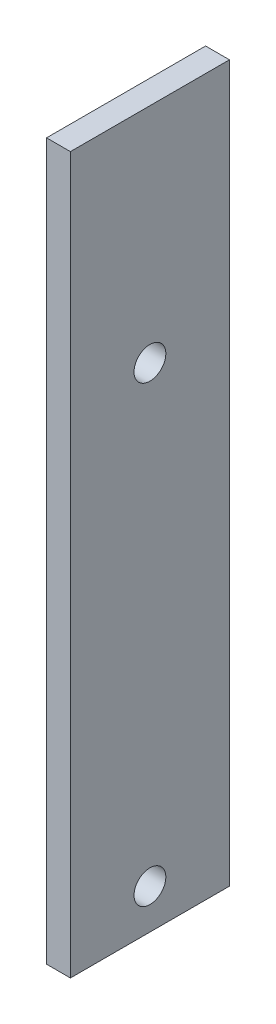
ISO-10303-21;
HEADER;
FILE_DESCRIPTION(('STEP AP214'),'2;1');
FILE_NAME('part.step','',(''),(''),'','','');
FILE_SCHEMA(('AUTOMOTIVE_DESIGN { 1 0 10303 214 1 1 1 1 }'));
ENDSEC;
DATA;
#1=APPLICATION_CONTEXT('core data for automotive mechanical design processes');
#2=APPLICATION_PROTOCOL_DEFINITION('international standard','automotive_design',2000,#1);
#3=PRODUCT_CONTEXT('',#1,'mechanical');
#4=PRODUCT('Part','Part','',(#3));
#5=PRODUCT_RELATED_PRODUCT_CATEGORY('part','',(#4));
#6=PRODUCT_DEFINITION_FORMATION('','',#4);
#7=PRODUCT_DEFINITION_CONTEXT('part definition',#1,'design');
#8=PRODUCT_DEFINITION('design','',#6,#7);
#9=PRODUCT_DEFINITION_SHAPE('','',#8);
#10=(LENGTH_UNIT() NAMED_UNIT(*) SI_UNIT(.MILLI.,.METRE.));
#11=(NAMED_UNIT(*) PLANE_ANGLE_UNIT() SI_UNIT($,.RADIAN.));
#12=(NAMED_UNIT(*) SI_UNIT($,.STERADIAN.) SOLID_ANGLE_UNIT());
#13=UNCERTAINTY_MEASURE_WITH_UNIT(LENGTH_MEASURE(1.E-05),#10,'distance_accuracy_value','');
#14=(GEOMETRIC_REPRESENTATION_CONTEXT(3) GLOBAL_UNCERTAINTY_ASSIGNED_CONTEXT((#13)) GLOBAL_UNIT_ASSIGNED_CONTEXT((#10,
#11,#12)) REPRESENTATION_CONTEXT('',''));
#15=CARTESIAN_POINT('',(0.,0.,0.));
#16=DIRECTION('',(0.,0.,1.));
#17=DIRECTION('',(1.,0.,0.));
#18=AXIS2_PLACEMENT_3D('',#15,#16,#17);
#19=CARTESIAN_POINT('',(3.,-45.,-10.));
#20=DIRECTION('',(0.,0.,1.));
#21=DIRECTION('',(1.,0.,0.));
#22=AXIS2_PLACEMENT_3D('',#19,#20,#21);
#23=PLANE('',#22);
#24=DIRECTION('',(0.,1.,0.));
#25=VECTOR('',#24,1.);
#26=CARTESIAN_POINT('',(0.,-45.,-10.));
#27=LINE('',#26,#25);
#28=CARTESIAN_POINT('',(0.,-45.,-10.));
#29=VERTEX_POINT('',#28);
#30=CARTESIAN_POINT('',(0.,45.,-10.));
#31=VERTEX_POINT('',#30);
#32=EDGE_CURVE('E96',#29,#31,#27,.T.);
#33=ORIENTED_EDGE('',*,*,#32,.T.);
#34=DIRECTION('',(-1.,0.,0.));
#35=VECTOR('',#34,1.);
#36=CARTESIAN_POINT('',(3.,45.,-10.));
#37=LINE('',#36,#35);
#38=CARTESIAN_POINT('',(3.,45.,-10.));
#39=VERTEX_POINT('',#38);
#40=EDGE_CURVE('E11',#39,#31,#37,.T.);
#41=ORIENTED_EDGE('',*,*,#40,.F.);
#42=DIRECTION('',(0.,1.,0.));
#43=VECTOR('',#42,1.);
#44=CARTESIAN_POINT('',(3.,-45.,-10.));
#45=LINE('',#44,#43);
#46=CARTESIAN_POINT('',(3.,-45.,-10.));
#47=VERTEX_POINT('',#46);
#48=EDGE_CURVE('E84',#47,#39,#45,.T.);
#49=ORIENTED_EDGE('',*,*,#48,.F.);
#50=DIRECTION('',(-1.,0.,0.));
#51=VECTOR('',#50,1.);
#52=CARTESIAN_POINT('',(3.,-45.,-10.));
#53=LINE('',#52,#51);
#54=EDGE_CURVE('E92',#47,#29,#53,.T.);
#55=ORIENTED_EDGE('',*,*,#54,.T.);
#56=EDGE_LOOP('',(#33,#41,#49,#55));
#57=FACE_BOUND('',#56,.T.);
#58=ADVANCED_FACE('F33',(#57),#23,.F.);
#59=CARTESIAN_POINT('',(3.,45.,10.));
#60=DIRECTION('',(0.,-1.,0.));
#61=DIRECTION('',(0.,0.,-1.));
#62=AXIS2_PLACEMENT_3D('',#59,#60,#61);
#63=PLANE('',#62);
#64=DIRECTION('',(0.,0.,1.));
#65=VECTOR('',#64,1.);
#66=CARTESIAN_POINT('',(0.,45.,10.));
#67=LINE('',#66,#65);
#68=CARTESIAN_POINT('',(0.,45.,10.));
#69=VERTEX_POINT('',#68);
#70=EDGE_CURVE('E88',#31,#69,#67,.T.);
#71=ORIENTED_EDGE('',*,*,#70,.T.);
#72=DIRECTION('',(-1.,0.,0.));
#73=VECTOR('',#72,1.);
#74=CARTESIAN_POINT('',(3.,45.,10.));
#75=LINE('',#74,#73);
#76=CARTESIAN_POINT('',(3.,45.,10.));
#77=VERTEX_POINT('',#76);
#78=EDGE_CURVE('E41',#77,#69,#75,.T.);
#79=ORIENTED_EDGE('',*,*,#78,.F.);
#80=DIRECTION('',(0.,0.,1.));
#81=VECTOR('',#80,1.);
#82=CARTESIAN_POINT('',(3.,45.,10.));
#83=LINE('',#82,#81);
#84=EDGE_CURVE('E79',#39,#77,#83,.T.);
#85=ORIENTED_EDGE('',*,*,#84,.F.);
#86=ORIENTED_EDGE('',*,*,#40,.T.);
#87=EDGE_LOOP('',(#71,#79,#85,#86));
#88=FACE_BOUND('',#87,.T.);
#89=ADVANCED_FACE('F87',(#88),#63,.F.);
#90=CARTESIAN_POINT('',(3.,-45.,10.));
#91=DIRECTION('',(0.,0.,-1.));
#92=DIRECTION('',(-1.,0.,0.));
#93=AXIS2_PLACEMENT_3D('',#90,#91,#92);
#94=PLANE('',#93);
#95=DIRECTION('',(0.,-1.,0.));
#96=VECTOR('',#95,1.);
#97=CARTESIAN_POINT('',(0.,-45.,10.));
#98=LINE('',#97,#96);
#99=CARTESIAN_POINT('',(0.,-45.,10.));
#100=VERTEX_POINT('',#99);
#101=EDGE_CURVE('E66',#69,#100,#98,.T.);
#102=ORIENTED_EDGE('',*,*,#101,.T.);
#103=DIRECTION('',(-1.,0.,0.));
#104=VECTOR('',#103,1.);
#105=CARTESIAN_POINT('',(3.,-45.,10.));
#106=LINE('',#105,#104);
#107=CARTESIAN_POINT('',(3.,-45.,10.));
#108=VERTEX_POINT('',#107);
#109=EDGE_CURVE('E89',#108,#100,#106,.T.);
#110=ORIENTED_EDGE('',*,*,#109,.F.);
#111=DIRECTION('',(0.,-1.,0.));
#112=VECTOR('',#111,1.);
#113=CARTESIAN_POINT('',(3.,-45.,10.));
#114=LINE('',#113,#112);
#115=EDGE_CURVE('E82',#77,#108,#114,.T.);
#116=ORIENTED_EDGE('',*,*,#115,.F.);
#117=ORIENTED_EDGE('',*,*,#78,.T.);
#118=EDGE_LOOP('',(#102,#110,#116,#117));
#119=FACE_BOUND('',#118,.T.);
#120=ADVANCED_FACE('F90',(#119),#94,.F.);
#121=CARTESIAN_POINT('',(3.,-45.,10.));
#122=DIRECTION('',(0.,1.,0.));
#123=DIRECTION('',(0.,0.,1.));
#124=AXIS2_PLACEMENT_3D('',#121,#122,#123);
#125=PLANE('',#124);
#126=DIRECTION('',(0.,0.,-1.));
#127=VECTOR('',#126,1.);
#128=CARTESIAN_POINT('',(0.,-45.,10.));
#129=LINE('',#128,#127);
#130=EDGE_CURVE('E72',#100,#29,#129,.T.);
#131=ORIENTED_EDGE('',*,*,#130,.T.);
#132=ORIENTED_EDGE('',*,*,#54,.F.);
#133=DIRECTION('',(0.,0.,-1.));
#134=VECTOR('',#133,1.);
#135=CARTESIAN_POINT('',(3.,-45.,10.));
#136=LINE('',#135,#134);
#137=EDGE_CURVE('E49',#108,#47,#136,.T.);
#138=ORIENTED_EDGE('',*,*,#137,.F.);
#139=ORIENTED_EDGE('',*,*,#109,.T.);
#140=EDGE_LOOP('',(#131,#132,#138,#139));
#141=FACE_BOUND('',#140,.T.);
#142=ADVANCED_FACE('F104',(#141),#125,.F.);
#143=CARTESIAN_POINT('',(3.,0.,0.));
#144=DIRECTION('',(-1.,0.,0.));
#145=DIRECTION('',(0.,0.,1.));
#146=AXIS2_PLACEMENT_3D('',#143,#144,#145);
#147=PLANE('',#146);
#148=CARTESIAN_POINT('',(3.,-40.,-5.95010152260045E-13));
#149=DIRECTION('',(1.,0.,0.));
#150=DIRECTION('',(0.,0.,-1.));
#151=AXIS2_PLACEMENT_3D('',#148,#149,#150);
#152=CIRCLE('',#151,2.);
#153=CARTESIAN_POINT('',(3.,-40.,-2.0000000000006));
#154=VERTEX_POINT('',#153);
#155=EDGE_CURVE('E118',#154,#154,#152,.T.);
#156=ORIENTED_EDGE('',*,*,#155,.F.);
#157=EDGE_LOOP('',(#156));
#158=FACE_BOUND('',#157,.T.);
#159=CARTESIAN_POINT('',(3.,17.,0.));
#160=DIRECTION('',(1.,0.,0.));
#161=DIRECTION('',(0.,0.,-1.));
#162=AXIS2_PLACEMENT_3D('',#159,#160,#161);
#163=CIRCLE('',#162,2.);
#164=CARTESIAN_POINT('',(3.,17.,-2.));
#165=VERTEX_POINT('',#164);
#166=EDGE_CURVE('E112',#165,#165,#163,.T.);
#167=ORIENTED_EDGE('',*,*,#166,.F.);
#168=EDGE_LOOP('',(#167));
#169=FACE_BOUND('',#168,.T.);
#170=ORIENTED_EDGE('',*,*,#48,.T.);
#171=ORIENTED_EDGE('',*,*,#84,.T.);
#172=ORIENTED_EDGE('',*,*,#115,.T.);
#173=ORIENTED_EDGE('',*,*,#137,.T.);
#174=EDGE_LOOP('',(#170,#171,#172,#173));
#175=FACE_BOUND('',#174,.T.);
#176=ADVANCED_FACE('F80',(#158,#169,#175),#147,.F.);
#177=CARTESIAN_POINT('',(0.,0.,0.));
#178=DIRECTION('',(-1.,0.,0.));
#179=DIRECTION('',(0.,0.,1.));
#180=AXIS2_PLACEMENT_3D('',#177,#178,#179);
#181=PLANE('',#180);
#182=CARTESIAN_POINT('',(0.,-40.,-5.95010152260045E-13));
#183=DIRECTION('',(-1.,0.,0.));
#184=DIRECTION('',(0.,0.,1.));
#185=AXIS2_PLACEMENT_3D('',#182,#183,#184);
#186=CIRCLE('',#185,2.);
#187=CARTESIAN_POINT('',(0.,-40.,1.99999999999941));
#188=VERTEX_POINT('',#187);
#189=EDGE_CURVE('E115',#188,#188,#186,.F.);
#190=ORIENTED_EDGE('',*,*,#189,.T.);
#191=EDGE_LOOP('',(#190));
#192=FACE_BOUND('',#191,.T.);
#193=CARTESIAN_POINT('',(0.,17.,0.));
#194=DIRECTION('',(-1.,0.,0.));
#195=DIRECTION('',(0.,0.,1.));
#196=AXIS2_PLACEMENT_3D('',#193,#194,#195);
#197=CIRCLE('',#196,2.);
#198=CARTESIAN_POINT('',(0.,17.,2.));
#199=VERTEX_POINT('',#198);
#200=EDGE_CURVE('E99',#199,#199,#197,.F.);
#201=ORIENTED_EDGE('',*,*,#200,.T.);
#202=EDGE_LOOP('',(#201));
#203=FACE_BOUND('',#202,.T.);
#204=ORIENTED_EDGE('',*,*,#32,.F.);
#205=ORIENTED_EDGE('',*,*,#130,.F.);
#206=ORIENTED_EDGE('',*,*,#101,.F.);
#207=ORIENTED_EDGE('',*,*,#70,.F.);
#208=EDGE_LOOP('',(#204,#205,#206,#207));
#209=FACE_BOUND('',#208,.T.);
#210=ADVANCED_FACE('F107',(#192,#203,#209),#181,.T.);
#211=CARTESIAN_POINT('',(-5.65685424949238,17.,0.));
#212=DIRECTION('',(1.,0.,0.));
#213=DIRECTION('',(0.,0.,-1.));
#214=AXIS2_PLACEMENT_3D('',#211,#212,#213);
#215=CYLINDRICAL_SURFACE('',#214,2.);
#216=ORIENTED_EDGE('',*,*,#166,.T.);
#217=EDGE_LOOP('',(#216));
#218=FACE_BOUND('',#217,.T.);
#219=ORIENTED_EDGE('',*,*,#200,.F.);
#220=EDGE_LOOP('',(#219));
#221=FACE_BOUND('',#220,.T.);
#222=ADVANCED_FACE('F130',(#218,#221),#215,.F.);
#223=CARTESIAN_POINT('',(-5.65685424949238,-40.,-5.95010152260045E-13));
#224=DIRECTION('',(1.,0.,0.));
#225=DIRECTION('',(0.,0.,-1.));
#226=AXIS2_PLACEMENT_3D('',#223,#224,#225);
#227=CYLINDRICAL_SURFACE('',#226,2.);
#228=ORIENTED_EDGE('',*,*,#155,.T.);
#229=EDGE_LOOP('',(#228));
#230=FACE_BOUND('',#229,.T.);
#231=ORIENTED_EDGE('',*,*,#189,.F.);
#232=EDGE_LOOP('',(#231));
#233=FACE_BOUND('',#232,.T.);
#234=ADVANCED_FACE('F122',(#230,#233),#227,.F.);
#235=CLOSED_SHELL('',(#58,#89,#120,#142,#176,#210,#222,#234));
#236=MANIFOLD_SOLID_BREP('B2',#235);
#237=ADVANCED_BREP_SHAPE_REPRESENTATION('',(#18,#236),#14);
#238=SHAPE_DEFINITION_REPRESENTATION(#9,#237);
ENDSEC;
END-ISO-10303-21;
